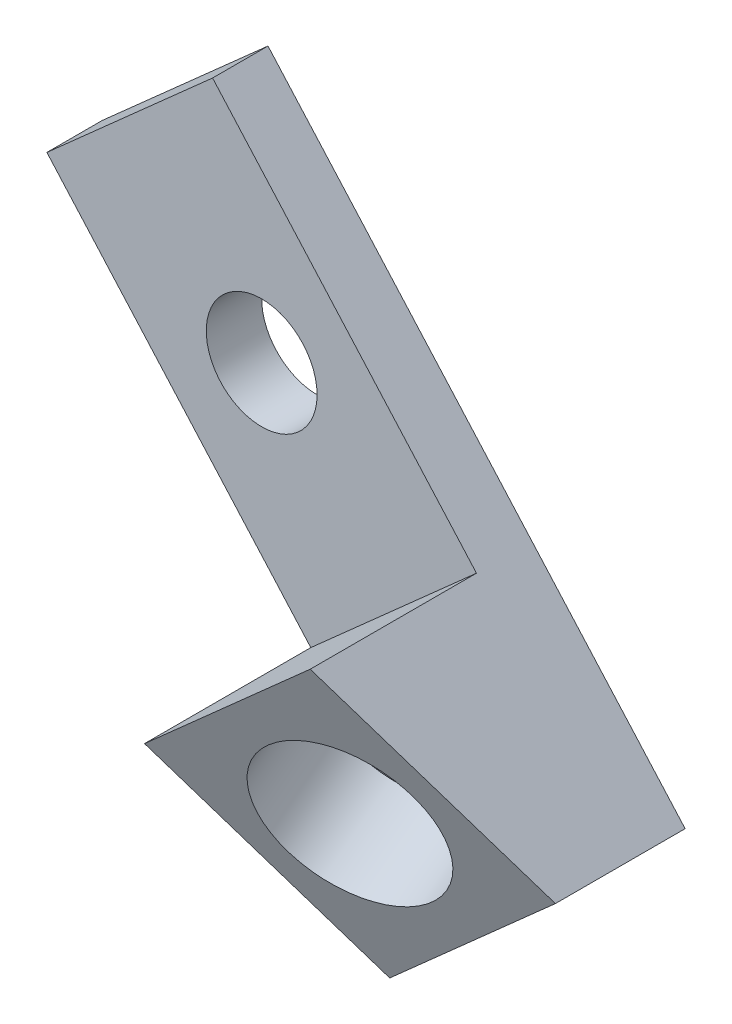
ISO-10303-21;
HEADER;
FILE_DESCRIPTION(('STEP AP214'),'2;1');
FILE_NAME('part.step','',(''),(''),'','','');
FILE_SCHEMA(('AUTOMOTIVE_DESIGN { 1 0 10303 214 1 1 1 1 }'));
ENDSEC;
DATA;
#1=APPLICATION_CONTEXT('core data for automotive mechanical design processes');
#2=APPLICATION_PROTOCOL_DEFINITION('international standard','automotive_design',2000,#1);
#3=PRODUCT_CONTEXT('',#1,'mechanical');
#4=PRODUCT('Part','Part','',(#3));
#5=PRODUCT_RELATED_PRODUCT_CATEGORY('part','',(#4));
#6=PRODUCT_DEFINITION_FORMATION('','',#4);
#7=PRODUCT_DEFINITION_CONTEXT('part definition',#1,'design');
#8=PRODUCT_DEFINITION('design','',#6,#7);
#9=PRODUCT_DEFINITION_SHAPE('','',#8);
#10=(LENGTH_UNIT() NAMED_UNIT(*) SI_UNIT(.MILLI.,.METRE.));
#11=(NAMED_UNIT(*) PLANE_ANGLE_UNIT() SI_UNIT($,.RADIAN.));
#12=(NAMED_UNIT(*) SI_UNIT($,.STERADIAN.) SOLID_ANGLE_UNIT());
#13=UNCERTAINTY_MEASURE_WITH_UNIT(LENGTH_MEASURE(1.E-05),#10,'distance_accuracy_value','');
#14=(GEOMETRIC_REPRESENTATION_CONTEXT(3) GLOBAL_UNCERTAINTY_ASSIGNED_CONTEXT((#13)) GLOBAL_UNIT_ASSIGNED_CONTEXT((#10,
#11,#12)) REPRESENTATION_CONTEXT('',''));
#15=CARTESIAN_POINT('',(0.,0.,0.));
#16=DIRECTION('',(0.,0.,1.));
#17=DIRECTION('',(1.,0.,0.));
#18=AXIS2_PLACEMENT_3D('',#15,#16,#17);
#19=CARTESIAN_POINT('',(-253.210596821346,165.733390030182,6.35));
#20=DIRECTION('',(0.66436383882992,-0.74740931868366,0.));
#21=DIRECTION('',(0.74740931868366,0.66436383882992,0.));
#22=AXIS2_PLACEMENT_3D('',#19,#20,#21);
#23=PLANE('',#22);
#24=DIRECTION('',(0.,0.,-1.));
#25=VECTOR('',#24,1.);
#26=CARTESIAN_POINT('',(-234.226400126781,182.608231536462,6.35));
#27=LINE('',#26,#25);
#28=CARTESIAN_POINT('',(-234.226400126781,182.608231536462,6.35));
#29=VERTEX_POINT('',#28);
#30=CARTESIAN_POINT('',(-234.226400126781,182.608231536462,0.));
#31=VERTEX_POINT('',#30);
#32=EDGE_CURVE('E117',#29,#31,#27,.T.);
#33=ORIENTED_EDGE('',*,*,#32,.T.);
#34=DIRECTION('',(0.74740931868366,0.66436383882992,0.));
#35=VECTOR('',#34,1.);
#36=CARTESIAN_POINT('',(-253.210596821346,165.733390030182,0.));
#37=LINE('',#36,#35);
#38=CARTESIAN_POINT('',(-253.210596821346,165.733390030182,0.));
#39=VERTEX_POINT('',#38);
#40=EDGE_CURVE('E11',#39,#31,#37,.T.);
#41=ORIENTED_EDGE('',*,*,#40,.F.);
#42=DIRECTION('',(0.,0.,-1.));
#43=VECTOR('',#42,1.);
#44=CARTESIAN_POINT('',(-253.210596821346,165.733390030182,6.35));
#45=LINE('',#44,#43);
#46=CARTESIAN_POINT('',(-253.210596821346,165.733390030182,6.35));
#47=VERTEX_POINT('',#46);
#48=EDGE_CURVE('E128',#47,#39,#45,.T.);
#49=ORIENTED_EDGE('',*,*,#48,.F.);
#50=DIRECTION('',(0.74740931868366,0.66436383882992,0.));
#51=VECTOR('',#50,1.);
#52=CARTESIAN_POINT('',(-253.210596821346,165.733390030182,6.35));
#53=LINE('',#52,#51);
#54=EDGE_CURVE('E113',#47,#29,#53,.T.);
#55=ORIENTED_EDGE('',*,*,#54,.T.);
#56=EDGE_LOOP('',(#33,#41,#49,#55));
#57=FACE_BOUND('',#56,.T.);
#58=ADVANCED_FACE('F33',(#57),#23,.F.);
#59=CARTESIAN_POINT('',(-253.210596821346,165.733390030182,0.));
#60=DIRECTION('',(0.,0.,1.));
#61=DIRECTION('',(0.,-1.,0.));
#62=AXIS2_PLACEMENT_3D('',#59,#60,#61);
#63=PLANE('',#62);
#64=CARTESIAN_POINT('',(-228.6,157.1625,0.));
#65=DIRECTION('',(0.,0.,1.));
#66=DIRECTION('',(1.,0.,0.));
#67=AXIS2_PLACEMENT_3D('',#64,#65,#66);
#68=CIRCLE('',#67,6.34999999999999);
#69=CARTESIAN_POINT('',(-222.25,157.1625,0.));
#70=VERTEX_POINT('',#69);
#71=EDGE_CURVE('E121',#70,#70,#68,.T.);
#72=ORIENTED_EDGE('',*,*,#71,.T.);
#73=EDGE_LOOP('',(#72));
#74=FACE_BOUND('',#73,.T.);
#75=DIRECTION('',(0.66436383882992,-0.747409318683659,0.));
#76=VECTOR('',#75,1.);
#77=CARTESIAN_POINT('',(-234.226400126781,182.608231536462,0.));
#78=LINE('',#77,#76);
#79=CARTESIAN_POINT('',(-186.434169538205,128.841972124314,0.));
#80=VERTEX_POINT('',#79);
#81=EDGE_CURVE('E120',#31,#80,#78,.T.);
#82=ORIENTED_EDGE('',*,*,#81,.T.);
#83=DIRECTION('',(0.74740931868366,0.66436383882992,0.));
#84=VECTOR('',#83,1.);
#85=CARTESIAN_POINT('',(-205.41836623277,111.967130618034,0.));
#86=LINE('',#85,#84);
#87=CARTESIAN_POINT('',(-205.41836623277,111.967130618034,0.));
#88=VERTEX_POINT('',#87);
#89=EDGE_CURVE('E41',#88,#80,#86,.T.);
#90=ORIENTED_EDGE('',*,*,#89,.F.);
#91=DIRECTION('',(0.66436383882992,-0.747409318683659,0.));
#92=VECTOR('',#91,1.);
#93=CARTESIAN_POINT('',(-253.210596821346,165.733390030182,0.));
#94=LINE('',#93,#92);
#95=EDGE_CURVE('E86',#39,#88,#94,.T.);
#96=ORIENTED_EDGE('',*,*,#95,.F.);
#97=ORIENTED_EDGE('',*,*,#40,.T.);
#98=EDGE_LOOP('',(#82,#90,#96,#97));
#99=FACE_BOUND('',#98,.T.);
#100=ADVANCED_FACE('F154',(#74,#99),#63,.F.);
#101=CARTESIAN_POINT('',(-205.41836623277,111.967130618034,0.));
#102=DIRECTION('',(-0.66436383882992,0.74740931868366,0.));
#103=DIRECTION('',(-0.74740931868366,-0.66436383882992,0.));
#104=AXIS2_PLACEMENT_3D('',#101,#102,#103);
#105=PLANE('',#104);
#106=DIRECTION('',(0.,0.,1.));
#107=VECTOR('',#106,1.);
#108=CARTESIAN_POINT('',(-186.434169538205,128.841972124314,0.));
#109=LINE('',#108,#107);
#110=CARTESIAN_POINT('',(-186.434169538205,128.841972124314,14.8617705092046));
#111=VERTEX_POINT('',#110);
#112=EDGE_CURVE('E123',#80,#111,#109,.T.);
#113=ORIENTED_EDGE('',*,*,#112,.T.);
#114=DIRECTION('',(0.74740931868366,0.66436383882992,0.));
#115=VECTOR('',#114,1.);
#116=CARTESIAN_POINT('',(-205.41836623277,111.967130618034,14.8617705092046));
#117=LINE('',#116,#115);
#118=CARTESIAN_POINT('',(-205.41836623277,111.967130618034,14.8617705092046));
#119=VERTEX_POINT('',#118);
#120=EDGE_CURVE('E108',#119,#111,#117,.T.);
#121=ORIENTED_EDGE('',*,*,#120,.F.);
#122=DIRECTION('',(0.,0.,1.));
#123=VECTOR('',#122,1.);
#124=CARTESIAN_POINT('',(-205.41836623277,111.967130618034,0.));
#125=LINE('',#124,#123);
#126=EDGE_CURVE('E99',#88,#119,#125,.T.);
#127=ORIENTED_EDGE('',*,*,#126,.F.);
#128=ORIENTED_EDGE('',*,*,#89,.T.);
#129=EDGE_LOOP('',(#113,#121,#127,#128));
#130=FACE_BOUND('',#129,.T.);
#131=ADVANCED_FACE('F134',(#130),#105,.F.);
#132=CARTESIAN_POINT('',(-205.41836623277,111.967130618034,14.8617705092046));
#133=DIRECTION('',(-0.246105828141715,0.276869056659429,-0.928857064794793));
#134=DIRECTION('',(0.,0.958332533986248,0.285654956728387));
#135=AXIS2_PLACEMENT_3D('',#132,#133,#134);
#136=PLANE('',#135);
#137=CARTESIAN_POINT('',(-204.703884705712,130.279370293926,20.1308852546023));
#138=DIRECTION('',(0.246105828141715,-0.276869056659429,0.928857064794793));
#139=DIRECTION('',(0.,-0.958332533986248,-0.285654956728387));
#140=AXIS2_PLACEMENT_3D('',#137,#138,#139);
#141=CIRCLE('',#140,9.52499999999998);
#142=CARTESIAN_POINT('',(-204.703884705712,121.151252907707,17.4100217917644));
#143=VERTEX_POINT('',#142);
#144=EDGE_CURVE('E171',#143,#143,#141,.T.);
#145=ORIENTED_EDGE('',*,*,#144,.F.);
#146=EDGE_LOOP('',(#145));
#147=FACE_BOUND('',#146,.T.);
#148=DIRECTION('',(-0.617099045291361,0.69423642595278,0.370438325745058));
#149=VECTOR('',#148,1.);
#150=CARTESIAN_POINT('',(-186.434169538205,128.841972124314,14.8617705092046));
#151=LINE('',#150,#149);
#152=CARTESIAN_POINT('',(-203.989403178654,148.591609969818,25.4));
#153=VERTEX_POINT('',#152);
#154=EDGE_CURVE('E107',#111,#153,#151,.T.);
#155=ORIENTED_EDGE('',*,*,#154,.T.);
#156=DIRECTION('',(0.74740931868366,0.66436383882992,0.));
#157=VECTOR('',#156,1.);
#158=CARTESIAN_POINT('',(-222.973599873219,131.716768463538,25.4));
#159=LINE('',#158,#157);
#160=CARTESIAN_POINT('',(-222.973599873219,131.716768463538,25.4));
#161=VERTEX_POINT('',#160);
#162=EDGE_CURVE('E104',#161,#153,#159,.T.);
#163=ORIENTED_EDGE('',*,*,#162,.F.);
#164=DIRECTION('',(-0.617099045291361,0.69423642595278,0.370438325745058));
#165=VECTOR('',#164,1.);
#166=CARTESIAN_POINT('',(-205.41836623277,111.967130618034,14.8617705092046));
#167=LINE('',#166,#165);
#168=EDGE_CURVE('E93',#119,#161,#167,.T.);
#169=ORIENTED_EDGE('',*,*,#168,.F.);
#170=ORIENTED_EDGE('',*,*,#120,.T.);
#171=EDGE_LOOP('',(#155,#163,#169,#170));
#172=FACE_BOUND('',#171,.T.);
#173=ADVANCED_FACE('F105',(#147,#172),#136,.F.);
#174=CARTESIAN_POINT('',(-222.973599873219,131.716768463538,25.4));
#175=DIRECTION('',(0.66436383882992,-0.74740931868366,0.));
#176=DIRECTION('',(0.74740931868366,0.66436383882992,0.));
#177=AXIS2_PLACEMENT_3D('',#174,#175,#176);
#178=PLANE('',#177);
#179=DIRECTION('',(0.,0.,-1.));
#180=VECTOR('',#179,1.);
#181=CARTESIAN_POINT('',(-203.989403178654,148.591609969818,25.4));
#182=LINE('',#181,#180);
#183=CARTESIAN_POINT('',(-203.989403178654,148.591609969818,6.35));
#184=VERTEX_POINT('',#183);
#185=EDGE_CURVE('E72',#153,#184,#182,.T.);
#186=ORIENTED_EDGE('',*,*,#185,.T.);
#187=DIRECTION('',(0.74740931868366,0.66436383882992,0.));
#188=VECTOR('',#187,1.);
#189=CARTESIAN_POINT('',(-222.973599873219,131.716768463538,6.35));
#190=LINE('',#189,#188);
#191=CARTESIAN_POINT('',(-222.973599873219,131.716768463538,6.35));
#192=VERTEX_POINT('',#191);
#193=EDGE_CURVE('E109',#192,#184,#190,.T.);
#194=ORIENTED_EDGE('',*,*,#193,.F.);
#195=DIRECTION('',(0.,0.,-1.));
#196=VECTOR('',#195,1.);
#197=CARTESIAN_POINT('',(-222.973599873219,131.716768463538,25.4));
#198=LINE('',#197,#196);
#199=EDGE_CURVE('E97',#161,#192,#198,.T.);
#200=ORIENTED_EDGE('',*,*,#199,.F.);
#201=ORIENTED_EDGE('',*,*,#162,.T.);
#202=EDGE_LOOP('',(#186,#194,#200,#201));
#203=FACE_BOUND('',#202,.T.);
#204=ADVANCED_FACE('F111',(#203),#178,.F.);
#205=CARTESIAN_POINT('',(-222.973599873219,131.716768463538,6.35));
#206=DIRECTION('',(0.,0.,-1.));
#207=DIRECTION('',(0.,1.,0.));
#208=AXIS2_PLACEMENT_3D('',#205,#206,#207);
#209=PLANE('',#208);
#210=CARTESIAN_POINT('',(-228.6,157.1625,6.35000000000004));
#211=DIRECTION('',(0.,0.,1.));
#212=DIRECTION('',(1.,0.,0.));
#213=AXIS2_PLACEMENT_3D('',#210,#211,#212);
#214=CIRCLE('',#213,6.34999999999999);
#215=CARTESIAN_POINT('',(-222.25,157.1625,6.35000000000004));
#216=VERTEX_POINT('',#215);
#217=EDGE_CURVE('E176',#216,#216,#214,.T.);
#218=ORIENTED_EDGE('',*,*,#217,.F.);
#219=EDGE_LOOP('',(#218));
#220=FACE_BOUND('',#219,.T.);
#221=DIRECTION('',(-0.66436383882992,0.747409318683659,0.));
#222=VECTOR('',#221,1.);
#223=CARTESIAN_POINT('',(-203.989403178654,148.591609969818,6.35));
#224=LINE('',#223,#222);
#225=EDGE_CURVE('E78',#184,#29,#224,.T.);
#226=ORIENTED_EDGE('',*,*,#225,.T.);
#227=ORIENTED_EDGE('',*,*,#54,.F.);
#228=DIRECTION('',(-0.66436383882992,0.747409318683659,0.));
#229=VECTOR('',#228,1.);
#230=CARTESIAN_POINT('',(-222.973599873219,131.716768463538,6.35));
#231=LINE('',#230,#229);
#232=EDGE_CURVE('E49',#192,#47,#231,.T.);
#233=ORIENTED_EDGE('',*,*,#232,.F.);
#234=ORIENTED_EDGE('',*,*,#193,.T.);
#235=EDGE_LOOP('',(#226,#227,#233,#234));
#236=FACE_BOUND('',#235,.T.);
#237=ADVANCED_FACE('F141',(#220,#236),#209,.F.);
#238=CARTESIAN_POINT('',(-59.1534776576272,-52.580869029002,0.));
#239=DIRECTION('',(-0.747409318683659,-0.66436383882992,0.));
#240=DIRECTION('',(0.66436383882992,-0.747409318683659,0.));
#241=AXIS2_PLACEMENT_3D('',#238,#239,#240);
#242=PLANE('',#241);
#243=ORIENTED_EDGE('',*,*,#48,.T.);
#244=ORIENTED_EDGE('',*,*,#95,.T.);
#245=ORIENTED_EDGE('',*,*,#126,.T.);
#246=ORIENTED_EDGE('',*,*,#168,.T.);
#247=ORIENTED_EDGE('',*,*,#199,.T.);
#248=ORIENTED_EDGE('',*,*,#232,.T.);
#249=EDGE_LOOP('',(#243,#244,#245,#246,#247,#248));
#250=FACE_BOUND('',#249,.T.);
#251=ADVANCED_FACE('F95',(#250),#242,.T.);
#252=CARTESIAN_POINT('',(-40.1692809630622,-35.7060275227221,0.));
#253=DIRECTION('',(-0.747409318683659,-0.66436383882992,0.));
#254=DIRECTION('',(0.66436383882992,-0.747409318683659,0.));
#255=AXIS2_PLACEMENT_3D('',#252,#253,#254);
#256=PLANE('',#255);
#257=ORIENTED_EDGE('',*,*,#32,.F.);
#258=ORIENTED_EDGE('',*,*,#225,.F.);
#259=ORIENTED_EDGE('',*,*,#185,.F.);
#260=ORIENTED_EDGE('',*,*,#154,.F.);
#261=ORIENTED_EDGE('',*,*,#112,.F.);
#262=ORIENTED_EDGE('',*,*,#81,.F.);
#263=EDGE_LOOP('',(#257,#258,#259,#260,#261,#262));
#264=FACE_BOUND('',#263,.T.);
#265=ADVANCED_FACE('F137',(#264),#256,.F.);
#266=CARTESIAN_POINT('',(-228.6,157.1625,0.));
#267=DIRECTION('',(0.,0.,1.));
#268=DIRECTION('',(1.,0.,0.));
#269=AXIS2_PLACEMENT_3D('',#266,#267,#268);
#270=CYLINDRICAL_SURFACE('',#269,6.34999999999999);
#271=ORIENTED_EDGE('',*,*,#71,.F.);
#272=EDGE_LOOP('',(#271));
#273=FACE_BOUND('',#272,.T.);
#274=ORIENTED_EDGE('',*,*,#217,.T.);
#275=EDGE_LOOP('',(#274));
#276=FACE_BOUND('',#275,.T.);
#277=ADVANCED_FACE('F184',(#273,#276),#270,.F.);
#278=CARTESIAN_POINT('',(-207.516874321372,133.443983611543,9.51404900399781));
#279=DIRECTION('',(0.246105828141715,-0.276869056659429,0.928857064794793));
#280=DIRECTION('',(0.,-0.958332533986248,-0.285654956728387));
#281=AXIS2_PLACEMENT_3D('',#278,#279,#280);
#282=CYLINDRICAL_SURFACE('',#281,9.52499999999998);
#283=CARTESIAN_POINT('',(-207.516874321372,133.443983611543,9.51404900399781));
#284=DIRECTION('',(0.246105828141715,-0.276869056659429,0.928857064794793));
#285=DIRECTION('',(0.,-0.958332533986248,-0.285654956728387));
#286=AXIS2_PLACEMENT_3D('',#283,#284,#285);
#287=CIRCLE('',#286,9.52499999999998);
#288=CARTESIAN_POINT('',(-207.516874321372,124.315866225324,6.79318554115993));
#289=VERTEX_POINT('',#288);
#290=EDGE_CURVE('E173',#289,#289,#287,.T.);
#291=ORIENTED_EDGE('',*,*,#290,.F.);
#292=EDGE_LOOP('',(#291));
#293=FACE_BOUND('',#292,.T.);
#294=ORIENTED_EDGE('',*,*,#144,.T.);
#295=EDGE_LOOP('',(#294));
#296=FACE_BOUND('',#295,.T.);
#297=ADVANCED_FACE('F186',(#293,#296),#282,.F.);
#298=CARTESIAN_POINT('',(-207.516874321372,133.443983611543,9.51404900399781));
#299=DIRECTION('',(0.246105828141715,-0.276869056659429,0.928857064794793));
#300=DIRECTION('',(0.,-0.958332533986248,-0.285654956728387));
#301=AXIS2_PLACEMENT_3D('',#298,#299,#300);
#302=PLANE('',#301);
#303=ORIENTED_EDGE('',*,*,#290,.T.);
#304=EDGE_LOOP('',(#303));
#305=FACE_BOUND('',#304,.T.);
#306=ADVANCED_FACE('F193',(#305),#302,.T.);
#307=CLOSED_SHELL('',(#58,#100,#131,#173,#204,#237,#251,#265,#277,#297,#306));
#308=MANIFOLD_SOLID_BREP('B2',#307);
#309=ADVANCED_BREP_SHAPE_REPRESENTATION('',(#18,#308),#14);
#310=SHAPE_DEFINITION_REPRESENTATION(#9,#309);
ENDSEC;
END-ISO-10303-21;
